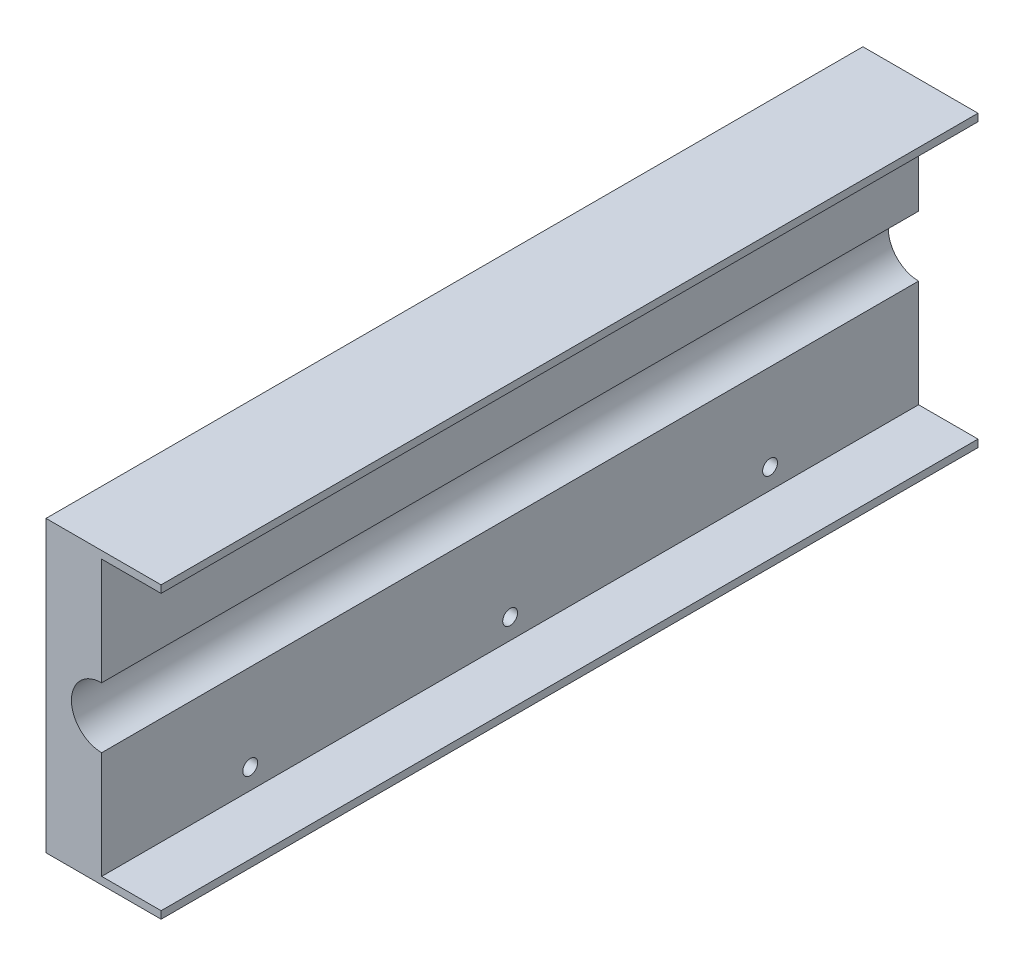
ISO-10303-21;
HEADER;
FILE_DESCRIPTION(('STEP AP214'),'2;1');
FILE_NAME('part.step','',(''),(''),'','','');
FILE_SCHEMA(('AUTOMOTIVE_DESIGN { 1 0 10303 214 1 1 1 1 }'));
ENDSEC;
DATA;
#1=APPLICATION_CONTEXT('core data for automotive mechanical design processes');
#2=APPLICATION_PROTOCOL_DEFINITION('international standard','automotive_design',2000,#1);
#3=PRODUCT_CONTEXT('',#1,'mechanical');
#4=PRODUCT('Part','Part','',(#3));
#5=PRODUCT_RELATED_PRODUCT_CATEGORY('part','',(#4));
#6=PRODUCT_DEFINITION_FORMATION('','',#4);
#7=PRODUCT_DEFINITION_CONTEXT('part definition',#1,'design');
#8=PRODUCT_DEFINITION('design','',#6,#7);
#9=PRODUCT_DEFINITION_SHAPE('','',#8);
#10=(LENGTH_UNIT() NAMED_UNIT(*) SI_UNIT(.MILLI.,.METRE.));
#11=(NAMED_UNIT(*) PLANE_ANGLE_UNIT() SI_UNIT($,.RADIAN.));
#12=(NAMED_UNIT(*) SI_UNIT($,.STERADIAN.) SOLID_ANGLE_UNIT());
#13=UNCERTAINTY_MEASURE_WITH_UNIT(LENGTH_MEASURE(1.E-05),#10,'distance_accuracy_value','');
#14=(GEOMETRIC_REPRESENTATION_CONTEXT(3) GLOBAL_UNCERTAINTY_ASSIGNED_CONTEXT((#13)) GLOBAL_UNIT_ASSIGNED_CONTEXT((#10,
#11,#12)) REPRESENTATION_CONTEXT('',''));
#15=CARTESIAN_POINT('',(0.,0.,0.));
#16=DIRECTION('',(0.,0.,1.));
#17=DIRECTION('',(1.,0.,0.));
#18=AXIS2_PLACEMENT_3D('',#15,#16,#17);
#19=CARTESIAN_POINT('',(0.,37.,220.));
#20=DIRECTION('',(1.,0.,0.));
#21=DIRECTION('',(0.,1.,0.));
#22=AXIS2_PLACEMENT_3D('',#19,#20,#21);
#23=PLANE('',#22);
#24=CARTESIAN_POINT('',(0.,31.5,180.));
#25=DIRECTION('',(1.,0.,0.));
#26=DIRECTION('',(0.,1.,0.));
#27=AXIS2_PLACEMENT_3D('',#24,#25,#26);
#28=CIRCLE('',#27,2.);
#29=CARTESIAN_POINT('',(0.,33.5,180.));
#30=VERTEX_POINT('',#29);
#31=EDGE_CURVE('E253',#30,#30,#28,.T.);
#32=ORIENTED_EDGE('',*,*,#31,.F.);
#33=EDGE_LOOP('',(#32));
#34=FACE_BOUND('',#33,.T.);
#35=CARTESIAN_POINT('',(0.,31.5,40.));
#36=DIRECTION('',(1.,0.,0.));
#37=DIRECTION('',(0.,1.,0.));
#38=AXIS2_PLACEMENT_3D('',#35,#36,#37);
#39=CIRCLE('',#38,2.);
#40=CARTESIAN_POINT('',(0.,33.5,40.));
#41=VERTEX_POINT('',#40);
#42=EDGE_CURVE('E249',#41,#41,#39,.T.);
#43=ORIENTED_EDGE('',*,*,#42,.F.);
#44=EDGE_LOOP('',(#43));
#45=FACE_BOUND('',#44,.T.);
#46=CARTESIAN_POINT('',(0.,31.5,110.));
#47=DIRECTION('',(1.,0.,0.));
#48=DIRECTION('',(0.,1.,0.));
#49=AXIS2_PLACEMENT_3D('',#46,#47,#48);
#50=CIRCLE('',#49,2.);
#51=CARTESIAN_POINT('',(0.,33.5,110.));
#52=VERTEX_POINT('',#51);
#53=EDGE_CURVE('E218',#52,#52,#50,.T.);
#54=ORIENTED_EDGE('',*,*,#53,.F.);
#55=EDGE_LOOP('',(#54));
#56=FACE_BOUND('',#55,.T.);
#57=DIRECTION('',(0.,-1.,0.));
#58=VECTOR('',#57,1.);
#59=CARTESIAN_POINT('',(0.,37.,0.));
#60=LINE('',#59,#58);
#61=CARTESIAN_POINT('',(0.,37.,0.));
#62=VERTEX_POINT('',#61);
#63=CARTESIAN_POINT('',(0.,8.15,0.));
#64=VERTEX_POINT('',#63);
#65=EDGE_CURVE('E62',#62,#64,#60,.T.);
#66=ORIENTED_EDGE('',*,*,#65,.F.);
#67=DIRECTION('',(0.,0.,-1.));
#68=VECTOR('',#67,1.);
#69=CARTESIAN_POINT('',(0.,37.,220.));
#70=LINE('',#69,#68);
#71=CARTESIAN_POINT('',(0.,37.,220.));
#72=VERTEX_POINT('',#71);
#73=EDGE_CURVE('E57',#72,#62,#70,.T.);
#74=ORIENTED_EDGE('',*,*,#73,.F.);
#75=DIRECTION('',(0.,-1.,0.));
#76=VECTOR('',#75,1.);
#77=CARTESIAN_POINT('',(0.,37.,220.));
#78=LINE('',#77,#76);
#79=CARTESIAN_POINT('',(0.,8.15,220.));
#80=VERTEX_POINT('',#79);
#81=EDGE_CURVE('E141',#72,#80,#78,.T.);
#82=ORIENTED_EDGE('',*,*,#81,.T.);
#83=DIRECTION('',(0.,0.,-1.));
#84=VECTOR('',#83,1.);
#85=CARTESIAN_POINT('',(0.,8.15,220.));
#86=LINE('',#85,#84);
#87=EDGE_CURVE('E49',#80,#64,#86,.T.);
#88=ORIENTED_EDGE('',*,*,#87,.T.);
#89=EDGE_LOOP('',(#66,#74,#82,#88));
#90=FACE_BOUND('',#89,.T.);
#91=ADVANCED_FACE('F39',(#34,#45,#56,#90),#23,.T.);
#92=CARTESIAN_POINT('',(0.,-8.15,220.));
#93=DIRECTION('',(1.,0.,0.));
#94=DIRECTION('',(0.,1.,0.));
#95=AXIS2_PLACEMENT_3D('',#92,#93,#94);
#96=PLANE('',#95);
#97=CARTESIAN_POINT('',(0.,-31.5,40.));
#98=DIRECTION('',(1.,0.,0.));
#99=DIRECTION('',(0.,1.,0.));
#100=AXIS2_PLACEMENT_3D('',#97,#98,#99);
#101=CIRCLE('',#100,2.);
#102=CARTESIAN_POINT('',(0.,-29.5,40.));
#103=VERTEX_POINT('',#102);
#104=EDGE_CURVE('E43',#103,#103,#101,.T.);
#105=ORIENTED_EDGE('',*,*,#104,.F.);
#106=EDGE_LOOP('',(#105));
#107=FACE_BOUND('',#106,.T.);
#108=CARTESIAN_POINT('',(0.,-31.5,180.));
#109=DIRECTION('',(1.,0.,0.));
#110=DIRECTION('',(0.,1.,0.));
#111=AXIS2_PLACEMENT_3D('',#108,#109,#110);
#112=CIRCLE('',#111,2.);
#113=CARTESIAN_POINT('',(0.,-29.5,180.));
#114=VERTEX_POINT('',#113);
#115=EDGE_CURVE('E260',#114,#114,#112,.T.);
#116=ORIENTED_EDGE('',*,*,#115,.F.);
#117=EDGE_LOOP('',(#116));
#118=FACE_BOUND('',#117,.T.);
#119=CARTESIAN_POINT('',(0.,-31.5,110.));
#120=DIRECTION('',(1.,0.,0.));
#121=DIRECTION('',(0.,1.,0.));
#122=AXIS2_PLACEMENT_3D('',#119,#120,#121);
#123=CIRCLE('',#122,2.);
#124=CARTESIAN_POINT('',(0.,-29.5,110.));
#125=VERTEX_POINT('',#124);
#126=EDGE_CURVE('E257',#125,#125,#123,.T.);
#127=ORIENTED_EDGE('',*,*,#126,.F.);
#128=EDGE_LOOP('',(#127));
#129=FACE_BOUND('',#128,.T.);
#130=DIRECTION('',(0.,-1.,0.));
#131=VECTOR('',#130,1.);
#132=CARTESIAN_POINT('',(0.,-8.15,220.));
#133=LINE('',#132,#131);
#134=CARTESIAN_POINT('',(0.,-8.15,220.));
#135=VERTEX_POINT('',#134);
#136=CARTESIAN_POINT('',(0.,-37.,220.));
#137=VERTEX_POINT('',#136);
#138=EDGE_CURVE('E229',#135,#137,#133,.T.);
#139=ORIENTED_EDGE('',*,*,#138,.T.);
#140=DIRECTION('',(0.,0.,1.));
#141=VECTOR('',#140,1.);
#142=CARTESIAN_POINT('',(0.,-37.,220.));
#143=LINE('',#142,#141);
#144=CARTESIAN_POINT('',(0.,-37.,0.));
#145=VERTEX_POINT('',#144);
#146=EDGE_CURVE('E156',#145,#137,#143,.T.);
#147=ORIENTED_EDGE('',*,*,#146,.F.);
#148=DIRECTION('',(0.,-1.,0.));
#149=VECTOR('',#148,1.);
#150=CARTESIAN_POINT('',(0.,-8.15,0.));
#151=LINE('',#150,#149);
#152=CARTESIAN_POINT('',(0.,-8.15,0.));
#153=VERTEX_POINT('',#152);
#154=EDGE_CURVE('E222',#153,#145,#151,.T.);
#155=ORIENTED_EDGE('',*,*,#154,.F.);
#156=DIRECTION('',(0.,0.,-1.));
#157=VECTOR('',#156,1.);
#158=CARTESIAN_POINT('',(0.,-8.15,220.));
#159=LINE('',#158,#157);
#160=EDGE_CURVE('E11',#135,#153,#159,.T.);
#161=ORIENTED_EDGE('',*,*,#160,.F.);
#162=EDGE_LOOP('',(#139,#147,#155,#161));
#163=FACE_BOUND('',#162,.T.);
#164=ADVANCED_FACE('F272',(#107,#118,#129,#163),#96,.T.);
#165=CARTESIAN_POINT('',(-15.,-37.,220.));
#166=DIRECTION('',(-1.,0.,0.));
#167=DIRECTION('',(0.,0.,1.));
#168=AXIS2_PLACEMENT_3D('',#165,#166,#167);
#169=PLANE('',#168);
#170=CARTESIAN_POINT('',(-15.,31.5,180.));
#171=DIRECTION('',(-1.,0.,0.));
#172=DIRECTION('',(0.,0.,1.));
#173=AXIS2_PLACEMENT_3D('',#170,#171,#172);
#174=CIRCLE('',#173,2.);
#175=CARTESIAN_POINT('',(-15.,31.5,182.));
#176=VERTEX_POINT('',#175);
#177=EDGE_CURVE('E198',#176,#176,#174,.T.);
#178=ORIENTED_EDGE('',*,*,#177,.F.);
#179=EDGE_LOOP('',(#178));
#180=FACE_BOUND('',#179,.T.);
#181=CARTESIAN_POINT('',(-15.,31.5,40.));
#182=DIRECTION('',(-1.,0.,0.));
#183=DIRECTION('',(0.,0.,1.));
#184=AXIS2_PLACEMENT_3D('',#181,#182,#183);
#185=CIRCLE('',#184,2.);
#186=CARTESIAN_POINT('',(-15.,31.5,42.));
#187=VERTEX_POINT('',#186);
#188=EDGE_CURVE('E199',#187,#187,#185,.T.);
#189=ORIENTED_EDGE('',*,*,#188,.F.);
#190=EDGE_LOOP('',(#189));
#191=FACE_BOUND('',#190,.T.);
#192=CARTESIAN_POINT('',(-15.,-31.5,40.));
#193=DIRECTION('',(-1.,0.,0.));
#194=DIRECTION('',(0.,0.,1.));
#195=AXIS2_PLACEMENT_3D('',#192,#193,#194);
#196=CIRCLE('',#195,2.);
#197=CARTESIAN_POINT('',(-15.,-31.5,42.));
#198=VERTEX_POINT('',#197);
#199=EDGE_CURVE('E203',#198,#198,#196,.T.);
#200=ORIENTED_EDGE('',*,*,#199,.F.);
#201=EDGE_LOOP('',(#200));
#202=FACE_BOUND('',#201,.T.);
#203=CARTESIAN_POINT('',(-15.,31.5,110.));
#204=DIRECTION('',(-1.,0.,0.));
#205=DIRECTION('',(0.,0.,1.));
#206=AXIS2_PLACEMENT_3D('',#203,#204,#205);
#207=CIRCLE('',#206,2.);
#208=CARTESIAN_POINT('',(-15.,31.5,112.));
#209=VERTEX_POINT('',#208);
#210=EDGE_CURVE('E207',#209,#209,#207,.T.);
#211=ORIENTED_EDGE('',*,*,#210,.F.);
#212=EDGE_LOOP('',(#211));
#213=FACE_BOUND('',#212,.T.);
#214=CARTESIAN_POINT('',(-15.,-31.5,180.));
#215=DIRECTION('',(-1.,0.,0.));
#216=DIRECTION('',(0.,0.,1.));
#217=AXIS2_PLACEMENT_3D('',#214,#215,#216);
#218=CIRCLE('',#217,2.);
#219=CARTESIAN_POINT('',(-15.,-31.5,182.));
#220=VERTEX_POINT('',#219);
#221=EDGE_CURVE('E192',#220,#220,#218,.T.);
#222=ORIENTED_EDGE('',*,*,#221,.F.);
#223=EDGE_LOOP('',(#222));
#224=FACE_BOUND('',#223,.T.);
#225=CARTESIAN_POINT('',(-15.,-31.5,110.));
#226=DIRECTION('',(-1.,0.,0.));
#227=DIRECTION('',(0.,0.,1.));
#228=AXIS2_PLACEMENT_3D('',#225,#226,#227);
#229=CIRCLE('',#228,2.);
#230=CARTESIAN_POINT('',(-15.,-31.5,112.));
#231=VERTEX_POINT('',#230);
#232=EDGE_CURVE('E211',#231,#231,#229,.T.);
#233=ORIENTED_EDGE('',*,*,#232,.F.);
#234=EDGE_LOOP('',(#233));
#235=FACE_BOUND('',#234,.T.);
#236=DIRECTION('',(0.,1.,0.));
#237=VECTOR('',#236,1.);
#238=CARTESIAN_POINT('',(-15.,-37.,0.));
#239=LINE('',#238,#237);
#240=CARTESIAN_POINT('',(-15.,-39.,0.));
#241=VERTEX_POINT('',#240);
#242=CARTESIAN_POINT('',(-15.,39.,0.));
#243=VERTEX_POINT('',#242);
#244=EDGE_CURVE('E232',#241,#243,#239,.T.);
#245=ORIENTED_EDGE('',*,*,#244,.F.);
#246=DIRECTION('',(0.,0.,-1.));
#247=VECTOR('',#246,1.);
#248=CARTESIAN_POINT('',(-15.,-39.,220.));
#249=LINE('',#248,#247);
#250=CARTESIAN_POINT('',(-15.,-39.,220.));
#251=VERTEX_POINT('',#250);
#252=EDGE_CURVE('E184',#251,#241,#249,.T.);
#253=ORIENTED_EDGE('',*,*,#252,.F.);
#254=DIRECTION('',(0.,1.,0.));
#255=VECTOR('',#254,1.);
#256=CARTESIAN_POINT('',(-15.,-37.,220.));
#257=LINE('',#256,#255);
#258=CARTESIAN_POINT('',(-15.,39.,220.));
#259=VERTEX_POINT('',#258);
#260=EDGE_CURVE('E219',#251,#259,#257,.T.);
#261=ORIENTED_EDGE('',*,*,#260,.T.);
#262=DIRECTION('',(0.,0.,1.));
#263=VECTOR('',#262,1.);
#264=CARTESIAN_POINT('',(-15.,39.,220.));
#265=LINE('',#264,#263);
#266=EDGE_CURVE('E143',#243,#259,#265,.T.);
#267=ORIENTED_EDGE('',*,*,#266,.F.);
#268=EDGE_LOOP('',(#245,#253,#261,#267));
#269=FACE_BOUND('',#268,.T.);
#270=ADVANCED_FACE('F41',(#180,#191,#202,#213,#224,#235,#269),#169,.T.);
#271=CARTESIAN_POINT('',(0.,0.,220.));
#272=DIRECTION('',(0.,0.,-1.));
#273=DIRECTION('',(-1.,0.,0.));
#274=AXIS2_PLACEMENT_3D('',#271,#272,#273);
#275=CYLINDRICAL_SURFACE('',#274,8.15);
#276=CARTESIAN_POINT('',(0.,0.,0.));
#277=DIRECTION('',(0.,0.,1.));
#278=DIRECTION('',(1.,0.,0.));
#279=AXIS2_PLACEMENT_3D('',#276,#277,#278);
#280=CIRCLE('',#279,8.15);
#281=EDGE_CURVE('E237',#64,#153,#280,.T.);
#282=ORIENTED_EDGE('',*,*,#281,.F.);
#283=ORIENTED_EDGE('',*,*,#87,.F.);
#284=CARTESIAN_POINT('',(0.,0.,220.));
#285=DIRECTION('',(0.,0.,1.));
#286=DIRECTION('',(1.,0.,0.));
#287=AXIS2_PLACEMENT_3D('',#284,#285,#286);
#288=CIRCLE('',#287,8.15);
#289=EDGE_CURVE('E225',#80,#135,#288,.T.);
#290=ORIENTED_EDGE('',*,*,#289,.T.);
#291=ORIENTED_EDGE('',*,*,#160,.T.);
#292=EDGE_LOOP('',(#282,#283,#290,#291));
#293=FACE_BOUND('',#292,.T.);
#294=ADVANCED_FACE('F298',(#293),#275,.F.);
#295=CARTESIAN_POINT('',(0.,0.,220.));
#296=DIRECTION('',(0.,0.,1.));
#297=DIRECTION('',(1.,0.,0.));
#298=AXIS2_PLACEMENT_3D('',#295,#296,#297);
#299=PLANE('',#298);
#300=ORIENTED_EDGE('',*,*,#260,.F.);
#301=DIRECTION('',(1.,0.,0.));
#302=VECTOR('',#301,1.);
#303=CARTESIAN_POINT('',(-15.,-39.,220.));
#304=LINE('',#303,#302);
#305=CARTESIAN_POINT('',(16.,-39.,220.));
#306=VERTEX_POINT('',#305);
#307=EDGE_CURVE('E188',#251,#306,#304,.T.);
#308=ORIENTED_EDGE('',*,*,#307,.T.);
#309=DIRECTION('',(0.,-1.,0.));
#310=VECTOR('',#309,1.);
#311=CARTESIAN_POINT('',(16.,-37.,220.));
#312=LINE('',#311,#310);
#313=CARTESIAN_POINT('',(16.,-37.,220.));
#314=VERTEX_POINT('',#313);
#315=EDGE_CURVE('E159',#314,#306,#312,.T.);
#316=ORIENTED_EDGE('',*,*,#315,.F.);
#317=DIRECTION('',(-1.,0.,0.));
#318=VECTOR('',#317,1.);
#319=CARTESIAN_POINT('',(16.,-37.,220.));
#320=LINE('',#319,#318);
#321=EDGE_CURVE('E173',#314,#137,#320,.T.);
#322=ORIENTED_EDGE('',*,*,#321,.T.);
#323=ORIENTED_EDGE('',*,*,#138,.F.);
#324=ORIENTED_EDGE('',*,*,#289,.F.);
#325=ORIENTED_EDGE('',*,*,#81,.F.);
#326=DIRECTION('',(-1.,0.,0.));
#327=VECTOR('',#326,1.);
#328=CARTESIAN_POINT('',(16.,37.,220.));
#329=LINE('',#328,#327);
#330=CARTESIAN_POINT('',(16.,37.,220.));
#331=VERTEX_POINT('',#330);
#332=EDGE_CURVE('E120',#331,#72,#329,.T.);
#333=ORIENTED_EDGE('',*,*,#332,.F.);
#334=DIRECTION('',(0.,-1.,0.));
#335=VECTOR('',#334,1.);
#336=CARTESIAN_POINT('',(16.,37.,220.));
#337=LINE('',#336,#335);
#338=CARTESIAN_POINT('',(16.,39.,220.));
#339=VERTEX_POINT('',#338);
#340=EDGE_CURVE('E128',#339,#331,#337,.T.);
#341=ORIENTED_EDGE('',*,*,#340,.F.);
#342=DIRECTION('',(1.,0.,0.));
#343=VECTOR('',#342,1.);
#344=CARTESIAN_POINT('',(-15.,39.,220.));
#345=LINE('',#344,#343);
#346=EDGE_CURVE('E153',#259,#339,#345,.T.);
#347=ORIENTED_EDGE('',*,*,#346,.F.);
#348=EDGE_LOOP('',(#300,#308,#316,#322,#323,#324,#325,#333,#341,#347));
#349=FACE_BOUND('',#348,.T.);
#350=ADVANCED_FACE('F139',(#349),#299,.T.);
#351=CARTESIAN_POINT('',(0.,0.,0.));
#352=DIRECTION('',(0.,0.,1.));
#353=DIRECTION('',(1.,0.,0.));
#354=AXIS2_PLACEMENT_3D('',#351,#352,#353);
#355=PLANE('',#354);
#356=ORIENTED_EDGE('',*,*,#244,.T.);
#357=DIRECTION('',(1.,0.,0.));
#358=VECTOR('',#357,1.);
#359=CARTESIAN_POINT('',(-15.,39.,0.));
#360=LINE('',#359,#358);
#361=CARTESIAN_POINT('',(16.,39.,0.));
#362=VERTEX_POINT('',#361);
#363=EDGE_CURVE('E148',#243,#362,#360,.T.);
#364=ORIENTED_EDGE('',*,*,#363,.T.);
#365=DIRECTION('',(0.,1.,0.));
#366=VECTOR('',#365,1.);
#367=CARTESIAN_POINT('',(16.,37.,0.));
#368=LINE('',#367,#366);
#369=CARTESIAN_POINT('',(16.,37.,0.));
#370=VERTEX_POINT('',#369);
#371=EDGE_CURVE('E127',#370,#362,#368,.T.);
#372=ORIENTED_EDGE('',*,*,#371,.F.);
#373=DIRECTION('',(-1.,0.,0.));
#374=VECTOR('',#373,1.);
#375=CARTESIAN_POINT('',(16.,37.,0.));
#376=LINE('',#375,#374);
#377=EDGE_CURVE('E122',#370,#62,#376,.T.);
#378=ORIENTED_EDGE('',*,*,#377,.T.);
#379=ORIENTED_EDGE('',*,*,#65,.T.);
#380=ORIENTED_EDGE('',*,*,#281,.T.);
#381=ORIENTED_EDGE('',*,*,#154,.T.);
#382=DIRECTION('',(-1.,0.,0.));
#383=VECTOR('',#382,1.);
#384=CARTESIAN_POINT('',(16.,-37.,0.));
#385=LINE('',#384,#383);
#386=CARTESIAN_POINT('',(16.,-37.,0.));
#387=VERTEX_POINT('',#386);
#388=EDGE_CURVE('E180',#387,#145,#385,.T.);
#389=ORIENTED_EDGE('',*,*,#388,.F.);
#390=DIRECTION('',(0.,1.,0.));
#391=VECTOR('',#390,1.);
#392=CARTESIAN_POINT('',(16.,-37.,0.));
#393=LINE('',#392,#391);
#394=CARTESIAN_POINT('',(16.,-39.,0.));
#395=VERTEX_POINT('',#394);
#396=EDGE_CURVE('E167',#395,#387,#393,.T.);
#397=ORIENTED_EDGE('',*,*,#396,.F.);
#398=DIRECTION('',(1.,0.,0.));
#399=VECTOR('',#398,1.);
#400=CARTESIAN_POINT('',(-15.,-39.,0.));
#401=LINE('',#400,#399);
#402=EDGE_CURVE('E189',#241,#395,#401,.T.);
#403=ORIENTED_EDGE('',*,*,#402,.F.);
#404=EDGE_LOOP('',(#356,#364,#372,#378,#379,#380,#381,#389,#397,#403));
#405=FACE_BOUND('',#404,.T.);
#406=ADVANCED_FACE('F294',(#405),#355,.F.);
#407=CARTESIAN_POINT('',(5.,31.5,110.));
#408=DIRECTION('',(-1.,0.,0.));
#409=DIRECTION('',(0.,0.,1.));
#410=AXIS2_PLACEMENT_3D('',#407,#408,#409);
#411=CYLINDRICAL_SURFACE('',#410,2.);
#412=ORIENTED_EDGE('',*,*,#53,.T.);
#413=EDGE_LOOP('',(#412));
#414=FACE_BOUND('',#413,.T.);
#415=ORIENTED_EDGE('',*,*,#210,.T.);
#416=EDGE_LOOP('',(#415));
#417=FACE_BOUND('',#416,.T.);
#418=ADVANCED_FACE('F310',(#414,#417),#411,.F.);
#419=CARTESIAN_POINT('',(5.,31.5,40.));
#420=DIRECTION('',(-1.,0.,0.));
#421=DIRECTION('',(0.,0.,1.));
#422=AXIS2_PLACEMENT_3D('',#419,#420,#421);
#423=CYLINDRICAL_SURFACE('',#422,2.);
#424=ORIENTED_EDGE('',*,*,#42,.T.);
#425=EDGE_LOOP('',(#424));
#426=FACE_BOUND('',#425,.T.);
#427=ORIENTED_EDGE('',*,*,#188,.T.);
#428=EDGE_LOOP('',(#427));
#429=FACE_BOUND('',#428,.T.);
#430=ADVANCED_FACE('F324',(#426,#429),#423,.F.);
#431=CARTESIAN_POINT('',(5.,31.5,180.));
#432=DIRECTION('',(-1.,0.,0.));
#433=DIRECTION('',(0.,0.,1.));
#434=AXIS2_PLACEMENT_3D('',#431,#432,#433);
#435=CYLINDRICAL_SURFACE('',#434,2.);
#436=ORIENTED_EDGE('',*,*,#31,.T.);
#437=EDGE_LOOP('',(#436));
#438=FACE_BOUND('',#437,.T.);
#439=ORIENTED_EDGE('',*,*,#177,.T.);
#440=EDGE_LOOP('',(#439));
#441=FACE_BOUND('',#440,.T.);
#442=ADVANCED_FACE('F317',(#438,#441),#435,.F.);
#443=CARTESIAN_POINT('',(5.,-31.5,110.));
#444=DIRECTION('',(-1.,0.,0.));
#445=DIRECTION('',(0.,0.,1.));
#446=AXIS2_PLACEMENT_3D('',#443,#444,#445);
#447=CYLINDRICAL_SURFACE('',#446,2.);
#448=ORIENTED_EDGE('',*,*,#126,.T.);
#449=EDGE_LOOP('',(#448));
#450=FACE_BOUND('',#449,.T.);
#451=ORIENTED_EDGE('',*,*,#232,.T.);
#452=EDGE_LOOP('',(#451));
#453=FACE_BOUND('',#452,.T.);
#454=ADVANCED_FACE('F313',(#450,#453),#447,.F.);
#455=CARTESIAN_POINT('',(5.,-31.5,180.));
#456=DIRECTION('',(-1.,0.,0.));
#457=DIRECTION('',(0.,0.,1.));
#458=AXIS2_PLACEMENT_3D('',#455,#456,#457);
#459=CYLINDRICAL_SURFACE('',#458,2.);
#460=ORIENTED_EDGE('',*,*,#115,.T.);
#461=EDGE_LOOP('',(#460));
#462=FACE_BOUND('',#461,.T.);
#463=ORIENTED_EDGE('',*,*,#221,.T.);
#464=EDGE_LOOP('',(#463));
#465=FACE_BOUND('',#464,.T.);
#466=ADVANCED_FACE('F316',(#462,#465),#459,.F.);
#467=CARTESIAN_POINT('',(5.,-31.5,40.));
#468=DIRECTION('',(-1.,0.,0.));
#469=DIRECTION('',(0.,0.,1.));
#470=AXIS2_PLACEMENT_3D('',#467,#468,#469);
#471=CYLINDRICAL_SURFACE('',#470,2.);
#472=ORIENTED_EDGE('',*,*,#104,.T.);
#473=EDGE_LOOP('',(#472));
#474=FACE_BOUND('',#473,.T.);
#475=ORIENTED_EDGE('',*,*,#199,.T.);
#476=EDGE_LOOP('',(#475));
#477=FACE_BOUND('',#476,.T.);
#478=ADVANCED_FACE('F269',(#474,#477),#471,.F.);
#479=CARTESIAN_POINT('',(-15.,-39.,220.));
#480=DIRECTION('',(0.,-1.,0.));
#481=DIRECTION('',(1.,0.,0.));
#482=AXIS2_PLACEMENT_3D('',#479,#480,#481);
#483=PLANE('',#482);
#484=ORIENTED_EDGE('',*,*,#402,.T.);
#485=DIRECTION('',(0.,0.,-1.));
#486=VECTOR('',#485,1.);
#487=CARTESIAN_POINT('',(16.,-39.,220.));
#488=LINE('',#487,#486);
#489=EDGE_CURVE('E163',#306,#395,#488,.T.);
#490=ORIENTED_EDGE('',*,*,#489,.F.);
#491=ORIENTED_EDGE('',*,*,#307,.F.);
#492=ORIENTED_EDGE('',*,*,#252,.T.);
#493=EDGE_LOOP('',(#484,#490,#491,#492));
#494=FACE_BOUND('',#493,.T.);
#495=ADVANCED_FACE('F321',(#494),#483,.T.);
#496=CARTESIAN_POINT('',(16.,-37.,220.));
#497=DIRECTION('',(0.,-1.,0.));
#498=DIRECTION('',(1.,0.,0.));
#499=AXIS2_PLACEMENT_3D('',#496,#497,#498);
#500=PLANE('',#499);
#501=ORIENTED_EDGE('',*,*,#146,.T.);
#502=ORIENTED_EDGE('',*,*,#321,.F.);
#503=DIRECTION('',(0.,0.,1.));
#504=VECTOR('',#503,1.);
#505=CARTESIAN_POINT('',(16.,-37.,220.));
#506=LINE('',#505,#504);
#507=EDGE_CURVE('E170',#387,#314,#506,.T.);
#508=ORIENTED_EDGE('',*,*,#507,.F.);
#509=ORIENTED_EDGE('',*,*,#388,.T.);
#510=EDGE_LOOP('',(#501,#502,#508,#509));
#511=FACE_BOUND('',#510,.T.);
#512=ADVANCED_FACE('F283',(#511),#500,.F.);
#513=CARTESIAN_POINT('',(16.,0.,0.));
#514=DIRECTION('',(1.,0.,0.));
#515=DIRECTION('',(0.,1.,0.));
#516=AXIS2_PLACEMENT_3D('',#513,#514,#515);
#517=PLANE('',#516);
#518=ORIENTED_EDGE('',*,*,#315,.T.);
#519=ORIENTED_EDGE('',*,*,#489,.T.);
#520=ORIENTED_EDGE('',*,*,#396,.T.);
#521=ORIENTED_EDGE('',*,*,#507,.T.);
#522=EDGE_LOOP('',(#518,#519,#520,#521));
#523=FACE_BOUND('',#522,.T.);
#524=ADVANCED_FACE('F290',(#523),#517,.T.);
#525=CARTESIAN_POINT('',(-15.,39.,220.));
#526=DIRECTION('',(0.,1.,0.));
#527=DIRECTION('',(-1.,0.,0.));
#528=AXIS2_PLACEMENT_3D('',#525,#526,#527);
#529=PLANE('',#528);
#530=ORIENTED_EDGE('',*,*,#346,.T.);
#531=DIRECTION('',(0.,0.,1.));
#532=VECTOR('',#531,1.);
#533=CARTESIAN_POINT('',(16.,39.,220.));
#534=LINE('',#533,#532);
#535=EDGE_CURVE('E134',#362,#339,#534,.T.);
#536=ORIENTED_EDGE('',*,*,#535,.F.);
#537=ORIENTED_EDGE('',*,*,#363,.F.);
#538=ORIENTED_EDGE('',*,*,#266,.T.);
#539=EDGE_LOOP('',(#530,#536,#537,#538));
#540=FACE_BOUND('',#539,.T.);
#541=ADVANCED_FACE('F341',(#540),#529,.T.);
#542=CARTESIAN_POINT('',(16.,37.,220.));
#543=DIRECTION('',(0.,1.,0.));
#544=DIRECTION('',(-1.,0.,0.));
#545=AXIS2_PLACEMENT_3D('',#542,#543,#544);
#546=PLANE('',#545);
#547=ORIENTED_EDGE('',*,*,#73,.T.);
#548=ORIENTED_EDGE('',*,*,#377,.F.);
#549=DIRECTION('',(0.,0.,-1.));
#550=VECTOR('',#549,1.);
#551=CARTESIAN_POINT('',(16.,37.,220.));
#552=LINE('',#551,#550);
#553=EDGE_CURVE('E116',#331,#370,#552,.T.);
#554=ORIENTED_EDGE('',*,*,#553,.F.);
#555=ORIENTED_EDGE('',*,*,#332,.T.);
#556=EDGE_LOOP('',(#547,#548,#554,#555));
#557=FACE_BOUND('',#556,.T.);
#558=ADVANCED_FACE('F118',(#557),#546,.F.);
#559=CARTESIAN_POINT('',(16.,0.,0.));
#560=DIRECTION('',(-1.,0.,0.));
#561=DIRECTION('',(0.,-1.,0.));
#562=AXIS2_PLACEMENT_3D('',#559,#560,#561);
#563=PLANE('',#562);
#564=ORIENTED_EDGE('',*,*,#340,.T.);
#565=ORIENTED_EDGE('',*,*,#553,.T.);
#566=ORIENTED_EDGE('',*,*,#371,.T.);
#567=ORIENTED_EDGE('',*,*,#535,.T.);
#568=EDGE_LOOP('',(#564,#565,#566,#567));
#569=FACE_BOUND('',#568,.T.);
#570=ADVANCED_FACE('F132',(#569),#563,.F.);
#571=CLOSED_SHELL('',(#91,#164,#270,#294,#350,#406,#418,#430,#442,#454,#466,#478,#495,#512,#524,
#541,#558,#570));
#572=MANIFOLD_SOLID_BREP('B2',#571);
#573=ADVANCED_BREP_SHAPE_REPRESENTATION('',(#18,#572),#14);
#574=SHAPE_DEFINITION_REPRESENTATION(#9,#573);
ENDSEC;
END-ISO-10303-21;
